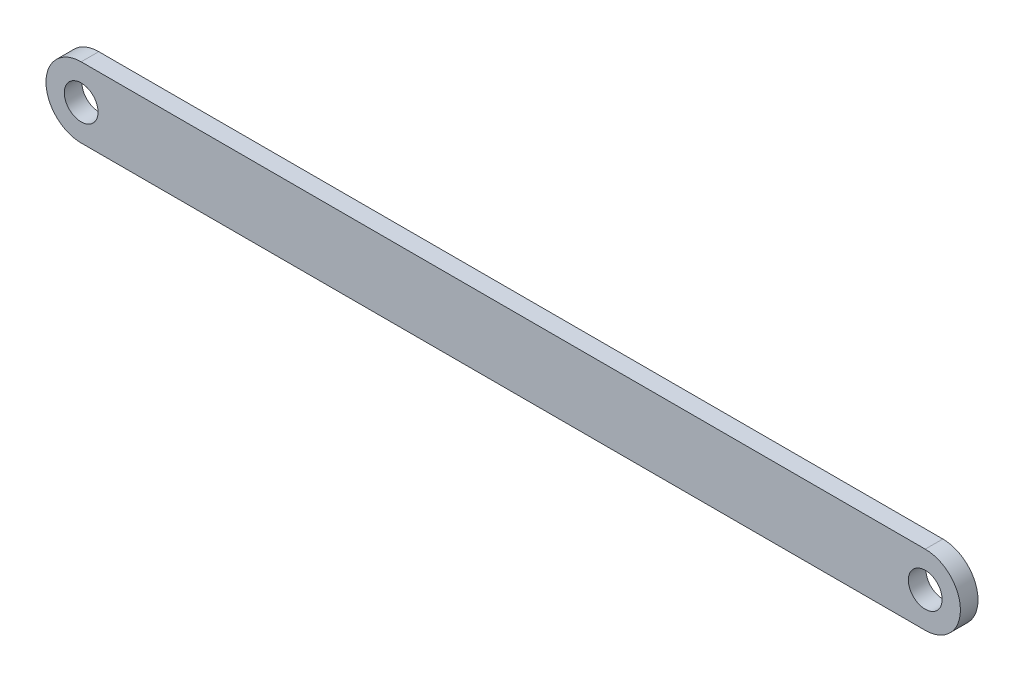
ISO-10303-21;
HEADER;
FILE_DESCRIPTION(('STEP AP214'),'2;1');
FILE_NAME('part.step','',(''),(''),'','','');
FILE_SCHEMA(('AUTOMOTIVE_DESIGN { 1 0 10303 214 1 1 1 1 }'));
ENDSEC;
DATA;
#1=APPLICATION_CONTEXT('core data for automotive mechanical design processes');
#2=APPLICATION_PROTOCOL_DEFINITION('international standard','automotive_design',2000,#1);
#3=PRODUCT_CONTEXT('',#1,'mechanical');
#4=PRODUCT('Part','Part','',(#3));
#5=PRODUCT_RELATED_PRODUCT_CATEGORY('part','',(#4));
#6=PRODUCT_DEFINITION_FORMATION('','',#4);
#7=PRODUCT_DEFINITION_CONTEXT('part definition',#1,'design');
#8=PRODUCT_DEFINITION('design','',#6,#7);
#9=PRODUCT_DEFINITION_SHAPE('','',#8);
#10=(LENGTH_UNIT() NAMED_UNIT(*) SI_UNIT(.MILLI.,.METRE.));
#11=(NAMED_UNIT(*) PLANE_ANGLE_UNIT() SI_UNIT($,.RADIAN.));
#12=(NAMED_UNIT(*) SI_UNIT($,.STERADIAN.) SOLID_ANGLE_UNIT());
#13=UNCERTAINTY_MEASURE_WITH_UNIT(LENGTH_MEASURE(1.E-05),#10,'distance_accuracy_value','');
#14=(GEOMETRIC_REPRESENTATION_CONTEXT(3) GLOBAL_UNCERTAINTY_ASSIGNED_CONTEXT((#13)) GLOBAL_UNIT_ASSIGNED_CONTEXT((#10,
#11,#12)) REPRESENTATION_CONTEXT('',''));
#15=CARTESIAN_POINT('',(0.,0.,0.));
#16=DIRECTION('',(0.,0.,1.));
#17=DIRECTION('',(1.,0.,0.));
#18=AXIS2_PLACEMENT_3D('',#15,#16,#17);
#19=CARTESIAN_POINT('',(76.2,0.,3.175));
#20=DIRECTION('',(0.,0.,-1.));
#21=DIRECTION('',(-1.,0.,0.));
#22=AXIS2_PLACEMENT_3D('',#19,#20,#21);
#23=PLANE('',#22);
#24=CARTESIAN_POINT('',(76.2,0.,3.175));
#25=DIRECTION('',(0.,0.,1.));
#26=DIRECTION('',(-1.,0.,0.));
#27=AXIS2_PLACEMENT_3D('',#24,#25,#26);
#28=CIRCLE('',#27,6.35);
#29=CARTESIAN_POINT('',(76.2,-6.35,3.175));
#30=VERTEX_POINT('',#29);
#31=CARTESIAN_POINT('',(76.2,6.35,3.175));
#32=VERTEX_POINT('',#31);
#33=EDGE_CURVE('E92',#30,#32,#28,.T.);
#34=ORIENTED_EDGE('',*,*,#33,.T.);
#35=DIRECTION('',(-1.,0.,0.));
#36=VECTOR('',#35,1.);
#37=CARTESIAN_POINT('',(-76.2,6.35,3.175));
#38=LINE('',#37,#36);
#39=CARTESIAN_POINT('',(-76.2,6.35,3.175));
#40=VERTEX_POINT('',#39);
#41=EDGE_CURVE('E87',#32,#40,#38,.T.);
#42=ORIENTED_EDGE('',*,*,#41,.T.);
#43=CARTESIAN_POINT('',(-76.2,0.,3.175));
#44=DIRECTION('',(0.,0.,1.));
#45=DIRECTION('',(1.,0.,0.));
#46=AXIS2_PLACEMENT_3D('',#43,#44,#45);
#47=CIRCLE('',#46,6.35);
#48=CARTESIAN_POINT('',(-76.2,-6.35,3.175));
#49=VERTEX_POINT('',#48);
#50=EDGE_CURVE('E90',#40,#49,#47,.T.);
#51=ORIENTED_EDGE('',*,*,#50,.T.);
#52=DIRECTION('',(1.,0.,0.));
#53=VECTOR('',#52,1.);
#54=CARTESIAN_POINT('',(-76.2,-6.35,3.175));
#55=LINE('',#54,#53);
#56=EDGE_CURVE('E57',#49,#30,#55,.T.);
#57=ORIENTED_EDGE('',*,*,#56,.T.);
#58=EDGE_LOOP('',(#34,#42,#51,#57));
#59=FACE_BOUND('',#58,.T.);
#60=CARTESIAN_POINT('',(-76.2,0.,3.175));
#61=DIRECTION('',(0.,0.,1.));
#62=DIRECTION('',(1.,0.,0.));
#63=AXIS2_PLACEMENT_3D('',#60,#61,#62);
#64=CIRCLE('',#63,3.048);
#65=CARTESIAN_POINT('',(-73.152,0.,3.175));
#66=VERTEX_POINT('',#65);
#67=EDGE_CURVE('E112',#66,#66,#64,.T.);
#68=ORIENTED_EDGE('',*,*,#67,.F.);
#69=EDGE_LOOP('',(#68));
#70=FACE_BOUND('',#69,.T.);
#71=CARTESIAN_POINT('',(76.2,0.,3.175));
#72=DIRECTION('',(0.,0.,1.));
#73=DIRECTION('',(1.,0.,0.));
#74=AXIS2_PLACEMENT_3D('',#71,#72,#73);
#75=CIRCLE('',#74,3.048);
#76=CARTESIAN_POINT('',(79.248,0.,3.175));
#77=VERTEX_POINT('',#76);
#78=EDGE_CURVE('E134',#77,#77,#75,.T.);
#79=ORIENTED_EDGE('',*,*,#78,.F.);
#80=EDGE_LOOP('',(#79));
#81=FACE_BOUND('',#80,.T.);
#82=ADVANCED_FACE('F39',(#59,#70,#81),#23,.F.);
#83=CARTESIAN_POINT('',(76.2,0.,0.));
#84=DIRECTION('',(0.,0.,-1.));
#85=DIRECTION('',(-1.,0.,0.));
#86=AXIS2_PLACEMENT_3D('',#83,#84,#85);
#87=PLANE('',#86);
#88=CARTESIAN_POINT('',(-76.2,0.,0.));
#89=DIRECTION('',(0.,0.,1.));
#90=DIRECTION('',(1.,0.,0.));
#91=AXIS2_PLACEMENT_3D('',#88,#89,#90);
#92=CIRCLE('',#91,3.048);
#93=CARTESIAN_POINT('',(-73.152,0.,0.));
#94=VERTEX_POINT('',#93);
#95=EDGE_CURVE('E130',#94,#94,#92,.T.);
#96=ORIENTED_EDGE('',*,*,#95,.T.);
#97=EDGE_LOOP('',(#96));
#98=FACE_BOUND('',#97,.T.);
#99=CARTESIAN_POINT('',(76.2,0.,0.));
#100=DIRECTION('',(0.,0.,1.));
#101=DIRECTION('',(-1.,0.,0.));
#102=AXIS2_PLACEMENT_3D('',#99,#100,#101);
#103=CIRCLE('',#102,6.35);
#104=CARTESIAN_POINT('',(76.2,-6.35,0.));
#105=VERTEX_POINT('',#104);
#106=CARTESIAN_POINT('',(76.2,6.35,0.));
#107=VERTEX_POINT('',#106);
#108=EDGE_CURVE('E108',#105,#107,#103,.T.);
#109=ORIENTED_EDGE('',*,*,#108,.F.);
#110=DIRECTION('',(1.,0.,0.));
#111=VECTOR('',#110,1.);
#112=CARTESIAN_POINT('',(-76.2,-6.35,0.));
#113=LINE('',#112,#111);
#114=CARTESIAN_POINT('',(-76.2,-6.35,0.));
#115=VERTEX_POINT('',#114);
#116=EDGE_CURVE('E80',#115,#105,#113,.T.);
#117=ORIENTED_EDGE('',*,*,#116,.F.);
#118=CARTESIAN_POINT('',(-76.2,0.,0.));
#119=DIRECTION('',(0.,0.,1.));
#120=DIRECTION('',(1.,0.,0.));
#121=AXIS2_PLACEMENT_3D('',#118,#119,#120);
#122=CIRCLE('',#121,6.35);
#123=CARTESIAN_POINT('',(-76.2,6.35,0.));
#124=VERTEX_POINT('',#123);
#125=EDGE_CURVE('E74',#124,#115,#122,.T.);
#126=ORIENTED_EDGE('',*,*,#125,.F.);
#127=DIRECTION('',(-1.,0.,0.));
#128=VECTOR('',#127,1.);
#129=CARTESIAN_POINT('',(-76.2,6.35,0.));
#130=LINE('',#129,#128);
#131=EDGE_CURVE('E97',#107,#124,#130,.T.);
#132=ORIENTED_EDGE('',*,*,#131,.F.);
#133=EDGE_LOOP('',(#109,#117,#126,#132));
#134=FACE_BOUND('',#133,.T.);
#135=CARTESIAN_POINT('',(76.2,0.,0.));
#136=DIRECTION('',(0.,0.,1.));
#137=DIRECTION('',(1.,0.,0.));
#138=AXIS2_PLACEMENT_3D('',#135,#136,#137);
#139=CIRCLE('',#138,3.048);
#140=CARTESIAN_POINT('',(79.248,0.,0.));
#141=VERTEX_POINT('',#140);
#142=EDGE_CURVE('E138',#141,#141,#139,.T.);
#143=ORIENTED_EDGE('',*,*,#142,.T.);
#144=EDGE_LOOP('',(#143));
#145=FACE_BOUND('',#144,.T.);
#146=ADVANCED_FACE('F125',(#98,#134,#145),#87,.T.);
#147=CARTESIAN_POINT('',(76.2,0.,3.175));
#148=DIRECTION('',(0.,0.,-1.));
#149=DIRECTION('',(-1.,0.,0.));
#150=AXIS2_PLACEMENT_3D('',#147,#148,#149);
#151=CYLINDRICAL_SURFACE('',#150,6.35);
#152=ORIENTED_EDGE('',*,*,#108,.T.);
#153=DIRECTION('',(0.,0.,-1.));
#154=VECTOR('',#153,1.);
#155=CARTESIAN_POINT('',(76.2,6.35,3.175));
#156=LINE('',#155,#154);
#157=EDGE_CURVE('E11',#32,#107,#156,.T.);
#158=ORIENTED_EDGE('',*,*,#157,.F.);
#159=ORIENTED_EDGE('',*,*,#33,.F.);
#160=DIRECTION('',(0.,0.,-1.));
#161=VECTOR('',#160,1.);
#162=CARTESIAN_POINT('',(76.2,-6.35,3.175));
#163=LINE('',#162,#161);
#164=EDGE_CURVE('E104',#30,#105,#163,.T.);
#165=ORIENTED_EDGE('',*,*,#164,.T.);
#166=EDGE_LOOP('',(#152,#158,#159,#165));
#167=FACE_BOUND('',#166,.T.);
#168=ADVANCED_FACE('F41',(#167),#151,.T.);
#169=CARTESIAN_POINT('',(-76.2,6.35,3.175));
#170=DIRECTION('',(0.,-1.,0.));
#171=DIRECTION('',(0.,0.,-1.));
#172=AXIS2_PLACEMENT_3D('',#169,#170,#171);
#173=PLANE('',#172);
#174=ORIENTED_EDGE('',*,*,#131,.T.);
#175=DIRECTION('',(0.,0.,-1.));
#176=VECTOR('',#175,1.);
#177=CARTESIAN_POINT('',(-76.2,6.35,3.175));
#178=LINE('',#177,#176);
#179=EDGE_CURVE('E49',#40,#124,#178,.T.);
#180=ORIENTED_EDGE('',*,*,#179,.F.);
#181=ORIENTED_EDGE('',*,*,#41,.F.);
#182=ORIENTED_EDGE('',*,*,#157,.T.);
#183=EDGE_LOOP('',(#174,#180,#181,#182));
#184=FACE_BOUND('',#183,.T.);
#185=ADVANCED_FACE('F96',(#184),#173,.F.);
#186=CARTESIAN_POINT('',(-76.2,0.,3.175));
#187=DIRECTION('',(0.,0.,-1.));
#188=DIRECTION('',(-1.,0.,0.));
#189=AXIS2_PLACEMENT_3D('',#186,#187,#188);
#190=CYLINDRICAL_SURFACE('',#189,6.35);
#191=ORIENTED_EDGE('',*,*,#125,.T.);
#192=DIRECTION('',(0.,0.,-1.));
#193=VECTOR('',#192,1.);
#194=CARTESIAN_POINT('',(-76.2,-6.35,3.175));
#195=LINE('',#194,#193);
#196=EDGE_CURVE('E99',#49,#115,#195,.T.);
#197=ORIENTED_EDGE('',*,*,#196,.F.);
#198=ORIENTED_EDGE('',*,*,#50,.F.);
#199=ORIENTED_EDGE('',*,*,#179,.T.);
#200=EDGE_LOOP('',(#191,#197,#198,#199));
#201=FACE_BOUND('',#200,.T.);
#202=ADVANCED_FACE('F100',(#201),#190,.T.);
#203=CARTESIAN_POINT('',(-76.2,-6.35,3.175));
#204=DIRECTION('',(0.,1.,0.));
#205=DIRECTION('',(0.,0.,1.));
#206=AXIS2_PLACEMENT_3D('',#203,#204,#205);
#207=PLANE('',#206);
#208=ORIENTED_EDGE('',*,*,#116,.T.);
#209=ORIENTED_EDGE('',*,*,#164,.F.);
#210=ORIENTED_EDGE('',*,*,#56,.F.);
#211=ORIENTED_EDGE('',*,*,#196,.T.);
#212=EDGE_LOOP('',(#208,#209,#210,#211));
#213=FACE_BOUND('',#212,.T.);
#214=ADVANCED_FACE('F122',(#213),#207,.F.);
#215=CARTESIAN_POINT('',(-76.2,0.,3.175));
#216=DIRECTION('',(0.,0.,-1.));
#217=DIRECTION('',(-1.,0.,0.));
#218=AXIS2_PLACEMENT_3D('',#215,#216,#217);
#219=CYLINDRICAL_SURFACE('',#218,3.048);
#220=ORIENTED_EDGE('',*,*,#67,.T.);
#221=EDGE_LOOP('',(#220));
#222=FACE_BOUND('',#221,.T.);
#223=ORIENTED_EDGE('',*,*,#95,.F.);
#224=EDGE_LOOP('',(#223));
#225=FACE_BOUND('',#224,.T.);
#226=ADVANCED_FACE('F157',(#222,#225),#219,.F.);
#227=CARTESIAN_POINT('',(76.2,0.,3.175));
#228=DIRECTION('',(0.,0.,-1.));
#229=DIRECTION('',(-1.,0.,0.));
#230=AXIS2_PLACEMENT_3D('',#227,#228,#229);
#231=CYLINDRICAL_SURFACE('',#230,3.048);
#232=ORIENTED_EDGE('',*,*,#78,.T.);
#233=EDGE_LOOP('',(#232));
#234=FACE_BOUND('',#233,.T.);
#235=ORIENTED_EDGE('',*,*,#142,.F.);
#236=EDGE_LOOP('',(#235));
#237=FACE_BOUND('',#236,.T.);
#238=ADVANCED_FACE('F146',(#234,#237),#231,.F.);
#239=CLOSED_SHELL('',(#82,#146,#168,#185,#202,#214,#226,#238));
#240=MANIFOLD_SOLID_BREP('B2',#239);
#241=ADVANCED_BREP_SHAPE_REPRESENTATION('',(#18,#240),#14);
#242=SHAPE_DEFINITION_REPRESENTATION(#9,#241);
ENDSEC;
END-ISO-10303-21;
